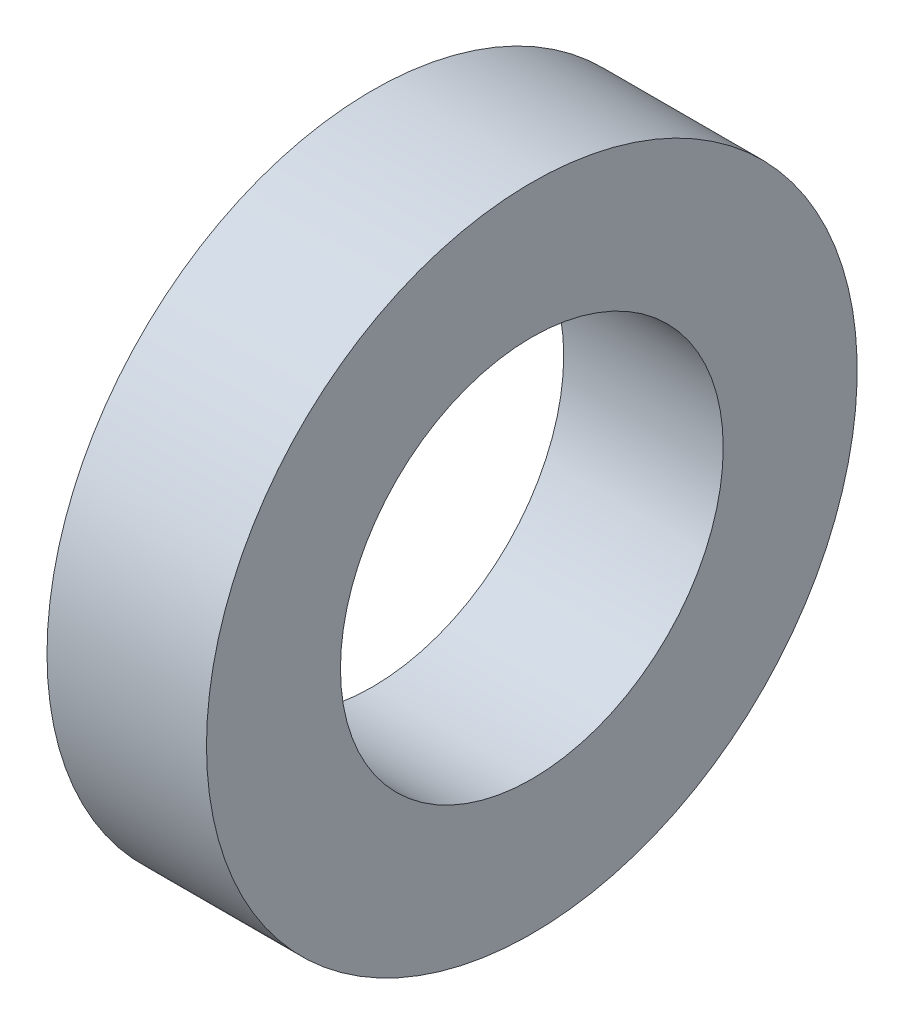
ISO-10303-21;
HEADER;
FILE_DESCRIPTION(('STEP AP214'),'2;1');
FILE_NAME('part.step','',(''),(''),'','','');
FILE_SCHEMA(('AUTOMOTIVE_DESIGN { 1 0 10303 214 1 1 1 1 }'));
ENDSEC;
DATA;
#1=APPLICATION_CONTEXT('core data for automotive mechanical design processes');
#2=APPLICATION_PROTOCOL_DEFINITION('international standard','automotive_design',2000,#1);
#3=PRODUCT_CONTEXT('',#1,'mechanical');
#4=PRODUCT('Part','Part','',(#3));
#5=PRODUCT_RELATED_PRODUCT_CATEGORY('part','',(#4));
#6=PRODUCT_DEFINITION_FORMATION('','',#4);
#7=PRODUCT_DEFINITION_CONTEXT('part definition',#1,'design');
#8=PRODUCT_DEFINITION('design','',#6,#7);
#9=PRODUCT_DEFINITION_SHAPE('','',#8);
#10=(LENGTH_UNIT() NAMED_UNIT(*) SI_UNIT(.MILLI.,.METRE.));
#11=(NAMED_UNIT(*) PLANE_ANGLE_UNIT() SI_UNIT($,.RADIAN.));
#12=(NAMED_UNIT(*) SI_UNIT($,.STERADIAN.) SOLID_ANGLE_UNIT());
#13=UNCERTAINTY_MEASURE_WITH_UNIT(LENGTH_MEASURE(1.E-05),#10,'distance_accuracy_value','');
#14=(GEOMETRIC_REPRESENTATION_CONTEXT(3) GLOBAL_UNCERTAINTY_ASSIGNED_CONTEXT((#13)) GLOBAL_UNIT_ASSIGNED_CONTEXT((#10,
#11,#12)) REPRESENTATION_CONTEXT('',''));
#15=CARTESIAN_POINT('',(0.,0.,0.));
#16=DIRECTION('',(0.,0.,1.));
#17=DIRECTION('',(1.,0.,0.));
#18=AXIS2_PLACEMENT_3D('',#15,#16,#17);
#19=CARTESIAN_POINT('',(0.,0.,0.));
#20=DIRECTION('',(-1.,0.,0.));
#21=DIRECTION('',(0.,0.,1.));
#22=AXIS2_PLACEMENT_3D('',#19,#20,#21);
#23=CYLINDRICAL_SURFACE('',#22,16.1925);
#24=CARTESIAN_POINT('',(-7.9375,0.,0.));
#25=DIRECTION('',(-1.,0.,0.));
#26=DIRECTION('',(0.,0.,1.));
#27=AXIS2_PLACEMENT_3D('',#24,#25,#26);
#28=CIRCLE('',#27,16.1925);
#29=CARTESIAN_POINT('',(-7.9375,0.,16.1925));
#30=VERTEX_POINT('',#29);
#31=EDGE_CURVE('E10',#30,#30,#28,.T.);
#32=ORIENTED_EDGE('',*,*,#31,.F.);
#33=EDGE_LOOP('',(#32));
#34=FACE_BOUND('',#33,.T.);
#35=CARTESIAN_POINT('',(0.,0.,0.));
#36=DIRECTION('',(-1.,0.,0.));
#37=DIRECTION('',(0.,0.,1.));
#38=AXIS2_PLACEMENT_3D('',#35,#36,#37);
#39=CIRCLE('',#38,16.1925);
#40=CARTESIAN_POINT('',(0.,0.,16.1925));
#41=VERTEX_POINT('',#40);
#42=EDGE_CURVE('E45',#41,#41,#39,.T.);
#43=ORIENTED_EDGE('',*,*,#42,.T.);
#44=EDGE_LOOP('',(#43));
#45=FACE_BOUND('',#44,.T.);
#46=ADVANCED_FACE('F31',(#34,#45),#23,.T.);
#47=CARTESIAN_POINT('',(-7.9375,16.1925,0.));
#48=DIRECTION('',(1.,0.,0.));
#49=DIRECTION('',(0.,0.,-1.));
#50=AXIS2_PLACEMENT_3D('',#47,#48,#49);
#51=PLANE('',#50);
#52=CARTESIAN_POINT('',(-7.9375,0.,0.));
#53=DIRECTION('',(-1.,0.,0.));
#54=DIRECTION('',(0.,0.,1.));
#55=AXIS2_PLACEMENT_3D('',#52,#53,#54);
#56=CIRCLE('',#55,9.525);
#57=CARTESIAN_POINT('',(-7.9375,0.,9.525));
#58=VERTEX_POINT('',#57);
#59=EDGE_CURVE('E37',#58,#58,#56,.T.);
#60=ORIENTED_EDGE('',*,*,#59,.F.);
#61=EDGE_LOOP('',(#60));
#62=FACE_BOUND('',#61,.T.);
#63=ORIENTED_EDGE('',*,*,#31,.T.);
#64=EDGE_LOOP('',(#63));
#65=FACE_BOUND('',#64,.T.);
#66=ADVANCED_FACE('F60',(#62,#65),#51,.F.);
#67=CARTESIAN_POINT('',(0.,0.,0.));
#68=DIRECTION('',(-1.,0.,0.));
#69=DIRECTION('',(0.,0.,1.));
#70=AXIS2_PLACEMENT_3D('',#67,#68,#69);
#71=CYLINDRICAL_SURFACE('',#70,9.525);
#72=CARTESIAN_POINT('',(0.,0.,0.));
#73=DIRECTION('',(-1.,0.,0.));
#74=DIRECTION('',(0.,0.,1.));
#75=AXIS2_PLACEMENT_3D('',#72,#73,#74);
#76=CIRCLE('',#75,9.525);
#77=CARTESIAN_POINT('',(0.,0.,9.525));
#78=VERTEX_POINT('',#77);
#79=EDGE_CURVE('E41',#78,#78,#76,.T.);
#80=ORIENTED_EDGE('',*,*,#79,.F.);
#81=EDGE_LOOP('',(#80));
#82=FACE_BOUND('',#81,.T.);
#83=ORIENTED_EDGE('',*,*,#59,.T.);
#84=EDGE_LOOP('',(#83));
#85=FACE_BOUND('',#84,.T.);
#86=ADVANCED_FACE('F55',(#82,#85),#71,.F.);
#87=CARTESIAN_POINT('',(0.,9.525,0.));
#88=DIRECTION('',(-1.,0.,0.));
#89=DIRECTION('',(0.,0.,1.));
#90=AXIS2_PLACEMENT_3D('',#87,#88,#89);
#91=PLANE('',#90);
#92=ORIENTED_EDGE('',*,*,#42,.F.);
#93=EDGE_LOOP('',(#92));
#94=FACE_BOUND('',#93,.T.);
#95=ORIENTED_EDGE('',*,*,#79,.T.);
#96=EDGE_LOOP('',(#95));
#97=FACE_BOUND('',#96,.T.);
#98=ADVANCED_FACE('F52',(#94,#97),#91,.F.);
#99=CLOSED_SHELL('',(#46,#66,#86,#98));
#100=MANIFOLD_SOLID_BREP('B2',#99);
#101=ADVANCED_BREP_SHAPE_REPRESENTATION('',(#18,#100),#14);
#102=SHAPE_DEFINITION_REPRESENTATION(#9,#101);
ENDSEC;
END-ISO-10303-21;
